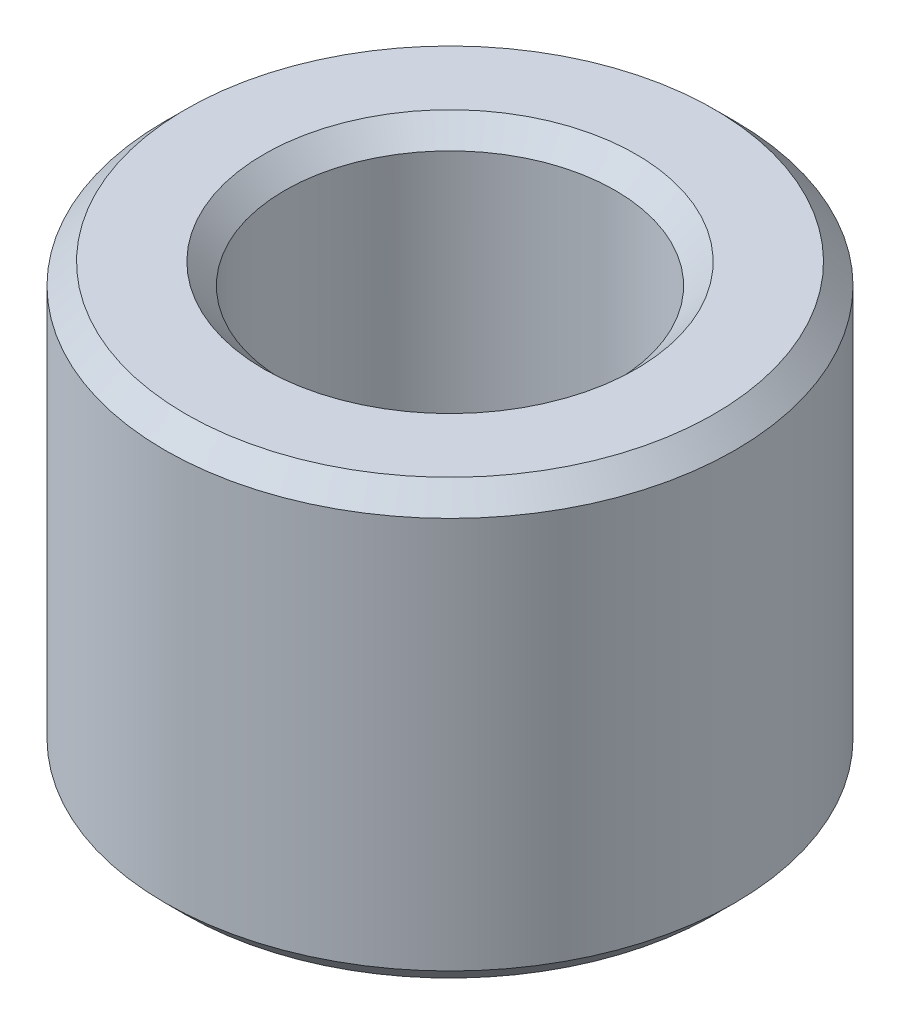
ISO-10303-21;
HEADER;
FILE_DESCRIPTION(('STEP AP214'),'2;1');
FILE_NAME('part.step','',(''),(''),'','','');
FILE_SCHEMA(('AUTOMOTIVE_DESIGN { 1 0 10303 214 1 1 1 1 }'));
ENDSEC;
DATA;
#1=APPLICATION_CONTEXT('core data for automotive mechanical design processes');
#2=APPLICATION_PROTOCOL_DEFINITION('international standard','automotive_design',2000,#1);
#3=PRODUCT_CONTEXT('',#1,'mechanical');
#4=PRODUCT('Part','Part','',(#3));
#5=PRODUCT_RELATED_PRODUCT_CATEGORY('part','',(#4));
#6=PRODUCT_DEFINITION_FORMATION('','',#4);
#7=PRODUCT_DEFINITION_CONTEXT('part definition',#1,'design');
#8=PRODUCT_DEFINITION('design','',#6,#7);
#9=PRODUCT_DEFINITION_SHAPE('','',#8);
#10=(LENGTH_UNIT() NAMED_UNIT(*) SI_UNIT(.MILLI.,.METRE.));
#11=(NAMED_UNIT(*) PLANE_ANGLE_UNIT() SI_UNIT($,.RADIAN.));
#12=(NAMED_UNIT(*) SI_UNIT($,.STERADIAN.) SOLID_ANGLE_UNIT());
#13=UNCERTAINTY_MEASURE_WITH_UNIT(LENGTH_MEASURE(1.E-05),#10,'distance_accuracy_value','');
#14=(GEOMETRIC_REPRESENTATION_CONTEXT(3) GLOBAL_UNCERTAINTY_ASSIGNED_CONTEXT((#13)) GLOBAL_UNIT_ASSIGNED_CONTEXT((#10,
#11,#12)) REPRESENTATION_CONTEXT('',''));
#15=CARTESIAN_POINT('',(0.,0.,0.));
#16=DIRECTION('',(0.,0.,1.));
#17=DIRECTION('',(1.,0.,0.));
#18=AXIS2_PLACEMENT_3D('',#15,#16,#17);
#19=CARTESIAN_POINT('',(0.,76.0880714020193,0.));
#20=DIRECTION('',(0.,-1.,0.));
#21=DIRECTION('',(0.,0.,-1.));
#22=AXIS2_PLACEMENT_3D('',#19,#20,#21);
#23=CYLINDRICAL_SURFACE('',#22,50.);
#24=CARTESIAN_POINT('',(0.,3.66118691810959,0.));
#25=DIRECTION('',(0.,1.,0.));
#26=DIRECTION('',(0.,0.,1.));
#27=AXIS2_PLACEMENT_3D('',#24,#25,#26);
#28=CIRCLE('',#27,50.);
#29=CARTESIAN_POINT('',(0.,3.66118691810958,50.));
#30=VERTEX_POINT('',#29);
#31=EDGE_CURVE('E10',#30,#30,#28,.T.);
#32=ORIENTED_EDGE('',*,*,#31,.T.);
#33=EDGE_LOOP('',(#32));
#34=FACE_BOUND('',#33,.T.);
#35=CARTESIAN_POINT('',(0.,72.4268844839096,0.));
#36=DIRECTION('',(0.,1.,0.));
#37=DIRECTION('',(0.,0.,1.));
#38=AXIS2_PLACEMENT_3D('',#35,#36,#37);
#39=CIRCLE('',#38,50.);
#40=CARTESIAN_POINT('',(0.,72.4268844839096,50.));
#41=VERTEX_POINT('',#40);
#42=EDGE_CURVE('E50',#41,#41,#39,.F.);
#43=ORIENTED_EDGE('',*,*,#42,.T.);
#44=EDGE_LOOP('',(#43));
#45=FACE_BOUND('',#44,.T.);
#46=ADVANCED_FACE('F39',(#34,#45),#23,.T.);
#47=CARTESIAN_POINT('',(0.,76.0880714020193,0.));
#48=DIRECTION('',(0.,1.,0.));
#49=DIRECTION('',(0.,0.,1.));
#50=AXIS2_PLACEMENT_3D('',#47,#48,#49);
#51=PLANE('',#50);
#52=CARTESIAN_POINT('',(0.,76.0880714020193,0.));
#53=DIRECTION('',(0.,1.,0.));
#54=DIRECTION('',(0.,0.,1.));
#55=AXIS2_PLACEMENT_3D('',#52,#53,#54);
#56=CIRCLE('',#55,32.6479878596683);
#57=CARTESIAN_POINT('',(0.,76.0880714020193,32.6479878596683));
#58=VERTEX_POINT('',#57);
#59=EDGE_CURVE('E58',#58,#58,#56,.F.);
#60=ORIENTED_EDGE('',*,*,#59,.T.);
#61=EDGE_LOOP('',(#60));
#62=FACE_BOUND('',#61,.T.);
#63=CARTESIAN_POINT('',(0.,76.0880714020193,0.));
#64=DIRECTION('',(0.,1.,0.));
#65=DIRECTION('',(0.,0.,1.));
#66=AXIS2_PLACEMENT_3D('',#63,#64,#65);
#67=CIRCLE('',#66,46.3388130818904);
#68=CARTESIAN_POINT('',(0.,76.0880714020193,46.3388130818904));
#69=VERTEX_POINT('',#68);
#70=EDGE_CURVE('E61',#69,#69,#67,.T.);
#71=ORIENTED_EDGE('',*,*,#70,.T.);
#72=EDGE_LOOP('',(#71));
#73=FACE_BOUND('',#72,.T.);
#74=ADVANCED_FACE('F88',(#62,#73),#51,.T.);
#75=CARTESIAN_POINT('',(0.,0.,0.));
#76=DIRECTION('',(0.,1.,0.));
#77=DIRECTION('',(0.,0.,1.));
#78=AXIS2_PLACEMENT_3D('',#75,#76,#77);
#79=PLANE('',#78);
#80=CARTESIAN_POINT('',(0.,0.,0.));
#81=DIRECTION('',(0.,1.,0.));
#82=DIRECTION('',(0.,0.,1.));
#83=AXIS2_PLACEMENT_3D('',#80,#81,#82);
#84=CIRCLE('',#83,32.6479878596683);
#85=CARTESIAN_POINT('',(0.,0.,-32.6479878596683));
#86=VERTEX_POINT('',#85);
#87=EDGE_CURVE('E51',#86,#86,#84,.T.);
#88=ORIENTED_EDGE('',*,*,#87,.T.);
#89=EDGE_LOOP('',(#88));
#90=FACE_BOUND('',#89,.T.);
#91=CARTESIAN_POINT('',(0.,0.,0.));
#92=DIRECTION('',(0.,1.,0.));
#93=DIRECTION('',(0.,0.,1.));
#94=AXIS2_PLACEMENT_3D('',#91,#92,#93);
#95=CIRCLE('',#94,46.3388130818904);
#96=CARTESIAN_POINT('',(0.,0.,46.3388130818904));
#97=VERTEX_POINT('',#96);
#98=EDGE_CURVE('E54',#97,#97,#95,.F.);
#99=ORIENTED_EDGE('',*,*,#98,.T.);
#100=EDGE_LOOP('',(#99));
#101=FACE_BOUND('',#100,.T.);
#102=ADVANCED_FACE('F83',(#90,#101),#79,.F.);
#103=CARTESIAN_POINT('',(0.,76.0880714020193,0.));
#104=DIRECTION('',(0.,-1.,0.));
#105=DIRECTION('',(0.,0.,-1.));
#106=AXIS2_PLACEMENT_3D('',#103,#104,#105);
#107=CYLINDRICAL_SURFACE('',#106,28.9868009415587);
#108=CARTESIAN_POINT('',(0.,72.4268844839097,0.));
#109=DIRECTION('',(0.,1.,0.));
#110=DIRECTION('',(0.,0.,1.));
#111=AXIS2_PLACEMENT_3D('',#108,#109,#110);
#112=CIRCLE('',#111,28.9868009415587);
#113=CARTESIAN_POINT('',(0.,72.4268844839097,28.9868009415587));
#114=VERTEX_POINT('',#113);
#115=EDGE_CURVE('E67',#114,#114,#112,.T.);
#116=ORIENTED_EDGE('',*,*,#115,.T.);
#117=EDGE_LOOP('',(#116));
#118=FACE_BOUND('',#117,.T.);
#119=CARTESIAN_POINT('',(0.,3.66118691810965,0.));
#120=DIRECTION('',(0.,1.,0.));
#121=DIRECTION('',(0.,0.,1.));
#122=AXIS2_PLACEMENT_3D('',#119,#120,#121);
#123=CIRCLE('',#122,28.9868009415587);
#124=CARTESIAN_POINT('',(0.,3.66118691810965,-28.9868009415587));
#125=VERTEX_POINT('',#124);
#126=EDGE_CURVE('E69',#125,#125,#123,.F.);
#127=ORIENTED_EDGE('',*,*,#126,.T.);
#128=EDGE_LOOP('',(#127));
#129=FACE_BOUND('',#128,.T.);
#130=ADVANCED_FACE('F71',(#118,#129),#107,.F.);
#131=CARTESIAN_POINT('',(0.,72.4268844839097,0.));
#132=DIRECTION('',(0.,1.,0.));
#133=DIRECTION('',(0.,0.,1.));
#134=AXIS2_PLACEMENT_3D('',#131,#132,#133);
#135=CONICAL_SURFACE('',#134,28.9868009415587,0.785398163397454);
#136=ORIENTED_EDGE('',*,*,#59,.F.);
#137=EDGE_LOOP('',(#136));
#138=FACE_BOUND('',#137,.T.);
#139=ORIENTED_EDGE('',*,*,#115,.F.);
#140=EDGE_LOOP('',(#139));
#141=FACE_BOUND('',#140,.T.);
#142=ADVANCED_FACE('F77',(#138,#141),#135,.F.);
#143=CARTESIAN_POINT('',(0.,0.,0.));
#144=DIRECTION('',(0.,-1.,0.));
#145=DIRECTION('',(0.,0.,-1.));
#146=AXIS2_PLACEMENT_3D('',#143,#144,#145);
#147=CONICAL_SURFACE('',#146,32.6479878596683,0.785398163397445);
#148=CARTESIAN_POINT('',(0.,3.66118691810965,-28.9868009415587));
#149=CARTESIAN_POINT('',(0.,3.62304955437934,-29.024938305289));
#150=CARTESIAN_POINT('',(0.,3.58491219064904,-29.0630756690193));
#151=CARTESIAN_POINT('',(0.,3.50863746318842,-29.1393503964799));
#152=CARTESIAN_POINT('',(0.,3.47050009945811,-29.1774877602102));
#153=CARTESIAN_POINT('',(0.,3.39422537199749,-29.2537624876708));
#154=CARTESIAN_POINT('',(0.,3.35608800826718,-29.2918998514012));
#155=CARTESIAN_POINT('',(0.,3.27981328080657,-29.3681745788618));
#156=CARTESIAN_POINT('',(0.,3.24167591707626,-29.4063119425921));
#157=CARTESIAN_POINT('',(0.,3.16540118961564,-29.4825866700527));
#158=CARTESIAN_POINT('',(0.,3.12726382588533,-29.520724033783));
#159=CARTESIAN_POINT('',(0.,3.05098909842471,-29.5969987612436));
#160=CARTESIAN_POINT('',(0.,3.0128517346944,-29.6351361249739));
#161=CARTESIAN_POINT('',(0.,2.93657700723379,-29.7114108524346));
#162=CARTESIAN_POINT('',(0.,2.89843964350348,-29.7495482161649));
#163=CARTESIAN_POINT('',(0.,2.82216491604286,-29.8258229436255));
#164=CARTESIAN_POINT('',(0.,2.78402755231255,-29.8639603073558));
#165=CARTESIAN_POINT('',(0.,2.70775282485193,-29.9402350348164));
#166=CARTESIAN_POINT('',(0.,2.66961546112162,-29.9783723985467));
#167=CARTESIAN_POINT('',(0.,2.593340733661,-30.0546471260073));
#168=CARTESIAN_POINT('',(0.,2.5552033699307,-30.0927844897376));
#169=CARTESIAN_POINT('',(0.,2.47892864247008,-30.1690592171983));
#170=CARTESIAN_POINT('',(0.,2.44079127873977,-30.2071965809286));
#171=CARTESIAN_POINT('',(0.,2.36451655127915,-30.2834713083892));
#172=CARTESIAN_POINT('',(0.,2.32637918754884,-30.3216086721195));
#173=CARTESIAN_POINT('',(0.,2.25010446008822,-30.3978833995801));
#174=CARTESIAN_POINT('',(0.,2.21196709635792,-30.4360207633104));
#175=CARTESIAN_POINT('',(0.,2.1356923688973,-30.512295490771));
#176=CARTESIAN_POINT('',(0.,2.09755500516699,-30.5504328545013));
#177=CARTESIAN_POINT('',(0.,2.02128027770637,-30.626707581962));
#178=CARTESIAN_POINT('',(0.,1.98314291397606,-30.6648449456923));
#179=CARTESIAN_POINT('',(0.,1.90686818651545,-30.7411196731529));
#180=CARTESIAN_POINT('',(0.,1.86873082278514,-30.7792570368832));
#181=CARTESIAN_POINT('',(0.,1.79245609532452,-30.8555317643438));
#182=CARTESIAN_POINT('',(0.,1.75431873159421,-30.8936691280741));
#183=CARTESIAN_POINT('',(0.,1.67804400413359,-30.9699438555347));
#184=CARTESIAN_POINT('',(0.,1.63990664040328,-31.008081219265));
#185=CARTESIAN_POINT('',(0.,1.56363191294266,-31.0843559467257));
#186=CARTESIAN_POINT('',(0.,1.52549454921236,-31.122493310456));
#187=CARTESIAN_POINT('',(0.,1.44921982175174,-31.1987680379166));
#188=CARTESIAN_POINT('',(0.,1.41108245802143,-31.2369054016469));
#189=CARTESIAN_POINT('',(0.,1.33480773056081,-31.3131801291075));
#190=CARTESIAN_POINT('',(0.,1.2966703668305,-31.3513174928378));
#191=CARTESIAN_POINT('',(0.,1.22039563936988,-31.4275922202984));
#192=CARTESIAN_POINT('',(0.,1.18225827563958,-31.4657295840287));
#193=CARTESIAN_POINT('',(0.,1.10598354817896,-31.5420043114894));
#194=CARTESIAN_POINT('',(0.,1.06784618444865,-31.5801416752197));
#195=CARTESIAN_POINT('',(0.,0.991571456988031,-31.6564164026803));
#196=CARTESIAN_POINT('',(0.,0.953434093257722,-31.6945537664106));
#197=CARTESIAN_POINT('',(0.,0.877159365797105,-31.7708284938712));
#198=CARTESIAN_POINT('',(0.,0.839022002066796,-31.8089658576015));
#199=CARTESIAN_POINT('',(0.,0.762747274606178,-31.8852405850621));
#200=CARTESIAN_POINT('',(0.,0.724609910875868,-31.9233779487924));
#201=CARTESIAN_POINT('',(0.,0.648335183415251,-31.9996526762531));
#202=CARTESIAN_POINT('',(0.,0.610197819684943,-32.0377900399834));
#203=CARTESIAN_POINT('',(0.,0.533923092224325,-32.114064767444));
#204=CARTESIAN_POINT('',(0.,0.495785728494016,-32.1522021311743));
#205=CARTESIAN_POINT('',(0.,0.419511001033398,-32.2284768586349));
#206=CARTESIAN_POINT('',(0.,0.381373637303088,-32.2666142223652));
#207=CARTESIAN_POINT('',(0.,0.305098909842471,-32.3428889498258));
#208=CARTESIAN_POINT('',(0.,0.266961546112163,-32.3810263135562));
#209=CARTESIAN_POINT('',(0.,0.190686818651545,-32.4573010410168));
#210=CARTESIAN_POINT('',(0.,0.152549454921236,-32.4954384047471));
#211=CARTESIAN_POINT('',(0.,0.0762747274606174,-32.5717131322077));
#212=CARTESIAN_POINT('',(0.,0.0381373637303081,-32.609850495938));
#213=CARTESIAN_POINT('',(0.,0.,-32.6479878596683));
#214=B_SPLINE_CURVE_WITH_KNOTS('',3,(#148,#149,#150,#151,#152,#153,#154,#155,#156,#157,#158,
#159,#160,#161,#162,#163,#164,#165,#166,#167,#168,#169,#170,#171,#172,#173,#174,#175,#176,#177,
#178,#179,#180,#181,#182,#183,#184,#185,#186,#187,#188,#189,#190,#191,#192,#193,#194,#195,#196,
#197,#198,#199,#200,#201,#202,#203,#204,#205,#206,#207,#208,#209,#210,#211,#212,#213),
.UNSPECIFIED.,.F.,.F.,(4,2,2,2,2,2,2,2,2,2,2,2,2,2,2,2,2,2,2,2,2,2,2,2,2,2,2,2,2,2,2,2,4),(0.,
0.161803131061674,0.323606262123351,0.485409393185027,0.647212524246701,0.809015655308375,
0.970818786370051,1.13262191743173,1.2944250484934,1.45622817955508,1.61803131061675,
1.77983444167843,1.9416375727401,2.10344070380178,2.26524383486345,2.42704696592513,
2.5888500969868,2.75065322804848,2.91245635911015,3.07425949017183,3.2360626212335,
3.39786575229518,3.55966888335686,3.72147201441853,3.88327514548021,4.04507827654188,
4.20688140760355,4.36868453866523,4.53048766972691,4.69229080078858,4.85409393185026,
5.01589706291193,5.17770019397361),.UNSPECIFIED.);
#215=EDGE_CURVE('BSEAM73',#125,#86,#214,.T.);
#216=ORIENTED_EDGE('',*,*,#126,.F.);
#217=ORIENTED_EDGE('',*,*,#87,.F.);
#218=ORIENTED_EDGE('',*,*,#215,.T.);
#219=ORIENTED_EDGE('',*,*,#215,.F.);
#220=EDGE_LOOP('',(#216,#218,#217,#219));
#221=FACE_BOUND('',#220,.T.);
#222=ADVANCED_FACE('F73',(#221),#147,.F.);
#223=CARTESIAN_POINT('',(0.,3.66118691810959,0.));
#224=DIRECTION('',(0.,1.,0.));
#225=DIRECTION('',(0.,0.,1.));
#226=AXIS2_PLACEMENT_3D('',#223,#224,#225);
#227=CONICAL_SURFACE('',#226,50.,0.785398163397451);
#228=CARTESIAN_POINT('',(0.,0.,46.3388130818904));
#229=CARTESIAN_POINT('',(0.,0.0381373637303076,46.3769504456207));
#230=CARTESIAN_POINT('',(0.,0.0762747274606159,46.415087809351));
#231=CARTESIAN_POINT('',(0.,0.152549454921232,46.4913625368116));
#232=CARTESIAN_POINT('',(0.,0.190686818651541,46.5294999005419));
#233=CARTESIAN_POINT('',(0.,0.266961546112157,46.6057746280026));
#234=CARTESIAN_POINT('',(0.,0.305098909842465,46.6439119917329));
#235=CARTESIAN_POINT('',(0.,0.381373637303082,46.7201867191935));
#236=CARTESIAN_POINT('',(0.,0.41951100103339,46.7583240829238));
#237=CARTESIAN_POINT('',(0.,0.495785728494006,46.8345988103844));
#238=CARTESIAN_POINT('',(0.,0.533923092224314,46.8727361741147));
#239=CARTESIAN_POINT('',(0.,0.61019781968493,46.9490109015753));
#240=CARTESIAN_POINT('',(0.,0.648335183415238,46.9871482653056));
#241=CARTESIAN_POINT('',(0.,0.724609910875855,47.0634229927663));
#242=CARTESIAN_POINT('',(0.,0.762747274606163,47.1015603564966));
#243=CARTESIAN_POINT('',(0.,0.839022002066779,47.1778350839572));
#244=CARTESIAN_POINT('',(0.,0.877159365797088,47.2159724476875));
#245=CARTESIAN_POINT('',(0.,0.953434093257704,47.2922471751481));
#246=CARTESIAN_POINT('',(0.,0.991571456988012,47.3303845388784));
#247=CARTESIAN_POINT('',(0.,1.06784618444863,47.406659266339));
#248=CARTESIAN_POINT('',(0.,1.10598354817894,47.4447966300693));
#249=CARTESIAN_POINT('',(0.,1.18225827563955,47.52107135753));
#250=CARTESIAN_POINT('',(0.,1.22039563936986,47.5592087212603));
#251=CARTESIAN_POINT('',(0.,1.29667036683048,47.6354834487209));
#252=CARTESIAN_POINT('',(0.,1.33480773056079,47.6736208124512));
#253=CARTESIAN_POINT('',(0.,1.4110824580214,47.7498955399118));
#254=CARTESIAN_POINT('',(0.,1.44921982175171,47.7880329036421));
#255=CARTESIAN_POINT('',(0.,1.52549454921233,47.8643076311027));
#256=CARTESIAN_POINT('',(0.,1.56363191294264,47.902444994833));
#257=CARTESIAN_POINT('',(0.,1.63990664040325,47.9787197222937));
#258=CARTESIAN_POINT('',(0.,1.67804400413356,48.016857086024));
#259=CARTESIAN_POINT('',(0.,1.75431873159418,48.0931318134846));
#260=CARTESIAN_POINT('',(0.,1.79245609532448,48.1312691772149));
#261=CARTESIAN_POINT('',(0.,1.8687308227851,48.2075439046755));
#262=CARTESIAN_POINT('',(0.,1.90686818651541,48.2456812684058));
#263=CARTESIAN_POINT('',(0.,1.98314291397602,48.3219559958664));
#264=CARTESIAN_POINT('',(0.,2.02128027770633,48.3600933595967));
#265=CARTESIAN_POINT('',(0.,2.09755500516695,48.4363680870574));
#266=CARTESIAN_POINT('',(0.,2.13569236889726,48.4745054507877));
#267=CARTESIAN_POINT('',(0.,2.21196709635787,48.5507801782483));
#268=CARTESIAN_POINT('',(0.,2.25010446008818,48.5889175419786));
#269=CARTESIAN_POINT('',(0.,2.3263791875488,48.6651922694392));
#270=CARTESIAN_POINT('',(0.,2.36451655127911,48.7033296331695));
#271=CARTESIAN_POINT('',(0.,2.44079127873972,48.7796043606301));
#272=CARTESIAN_POINT('',(0.,2.47892864247003,48.8177417243604));
#273=CARTESIAN_POINT('',(0.,2.55520336993065,48.8940164518211));
#274=CARTESIAN_POINT('',(0.,2.59334073366096,48.9321538155514));
#275=CARTESIAN_POINT('',(0.,2.66961546112157,49.008428543012));
#276=CARTESIAN_POINT('',(0.,2.70775282485188,49.0465659067423));
#277=CARTESIAN_POINT('',(0.,2.7840275523125,49.1228406342029));
#278=CARTESIAN_POINT('',(0.,2.8221649160428,49.1609779979332));
#279=CARTESIAN_POINT('',(0.,2.89843964350342,49.2372527253938));
#280=CARTESIAN_POINT('',(0.,2.93657700723373,49.2753900891241));
#281=CARTESIAN_POINT('',(0.,3.01285173469435,49.3516648165848));
#282=CARTESIAN_POINT('',(0.,3.05098909842465,49.3898021803151));
#283=CARTESIAN_POINT('',(0.,3.12726382588527,49.4660769077757));
#284=CARTESIAN_POINT('',(0.,3.16540118961558,49.504214271506));
#285=CARTESIAN_POINT('',(0.,3.24167591707619,49.5804889989666));
#286=CARTESIAN_POINT('',(0.,3.2798132808065,49.6186263626969));
#287=CARTESIAN_POINT('',(0.,3.35608800826712,49.6949010901575));
#288=CARTESIAN_POINT('',(0.,3.39422537199743,49.7330384538878));
#289=CARTESIAN_POINT('',(0.,3.47050009945804,49.8093131813485));
#290=CARTESIAN_POINT('',(0.,3.50863746318835,49.8474505450788));
#291=CARTESIAN_POINT('',(0.,3.58491219064897,49.9237252725394));
#292=CARTESIAN_POINT('',(0.,3.62304955437928,49.9618626362697));
#293=CARTESIAN_POINT('',(0.,3.66118691810958,50.));
#294=B_SPLINE_CURVE_WITH_KNOTS('',3,(#228,#229,#230,#231,#232,#233,#234,#235,#236,#237,#238,
#239,#240,#241,#242,#243,#244,#245,#246,#247,#248,#249,#250,#251,#252,#253,#254,#255,#256,#257,
#258,#259,#260,#261,#262,#263,#264,#265,#266,#267,#268,#269,#270,#271,#272,#273,#274,#275,#276,
#277,#278,#279,#280,#281,#282,#283,#284,#285,#286,#287,#288,#289,#290,#291,#292,#293),
.UNSPECIFIED.,.F.,.F.,(4,2,2,2,2,2,2,2,2,2,2,2,2,2,2,2,2,2,2,2,2,2,2,2,2,2,2,2,2,2,2,2,4),(0.,
0.161803131061672,0.323606262123345,0.485409393185017,0.64721252424669,0.809015655308367,
0.97081878637004,1.13262191743171,1.29442504849338,1.45622817955506,1.61803131061673,
1.77983444167841,1.94163757274008,2.10344070380175,2.26524383486342,2.4270469659251,
2.58885009698677,2.75065322804845,2.91245635911012,3.07425949017179,3.23606262123347,
3.39786575229514,3.55966888335681,3.72147201441849,3.88327514548016,4.04507827654183,
4.2068814076035,4.36868453866518,4.53048766972685,4.69229080078852,4.8540939318502,
5.01589706291187,5.17770019397354),.UNSPECIFIED.);
#295=EDGE_CURVE('BSEAM76',#97,#30,#294,.T.);
#296=ORIENTED_EDGE('',*,*,#98,.F.);
#297=ORIENTED_EDGE('',*,*,#31,.F.);
#298=ORIENTED_EDGE('',*,*,#295,.T.);
#299=ORIENTED_EDGE('',*,*,#295,.F.);
#300=EDGE_LOOP('',(#296,#298,#297,#299));
#301=FACE_BOUND('',#300,.T.);
#302=ADVANCED_FACE('F76',(#301),#227,.T.);
#303=CARTESIAN_POINT('',(0.,76.0880714020193,0.));
#304=DIRECTION('',(0.,-1.,0.));
#305=DIRECTION('',(0.,0.,-1.));
#306=AXIS2_PLACEMENT_3D('',#303,#304,#305);
#307=CONICAL_SURFACE('',#306,46.3388130818904,0.785398163397443);
#308=ORIENTED_EDGE('',*,*,#42,.F.);
#309=EDGE_LOOP('',(#308));
#310=FACE_BOUND('',#309,.T.);
#311=ORIENTED_EDGE('',*,*,#70,.F.);
#312=EDGE_LOOP('',(#311));
#313=FACE_BOUND('',#312,.T.);
#314=ADVANCED_FACE('F45',(#310,#313),#307,.T.);
#315=CLOSED_SHELL('',(#46,#74,#102,#130,#142,#222,#302,#314));
#316=MANIFOLD_SOLID_BREP('B2',#315);
#317=ADVANCED_BREP_SHAPE_REPRESENTATION('',(#18,#316),#14);
#318=SHAPE_DEFINITION_REPRESENTATION(#9,#317);
ENDSEC;
END-ISO-10303-21;
